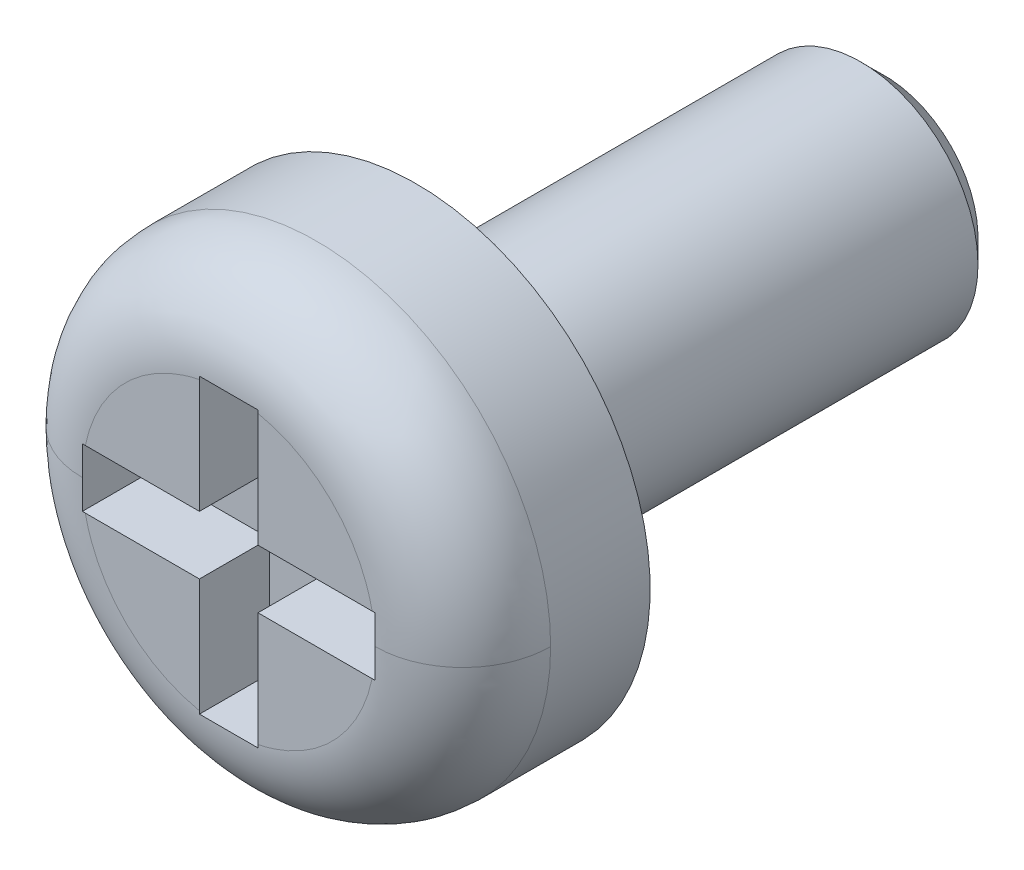
ISO-10303-21;
HEADER;
FILE_DESCRIPTION(('STEP AP214'),'2;1');
FILE_NAME('part.step','',(''),(''),'','','');
FILE_SCHEMA(('AUTOMOTIVE_DESIGN { 1 0 10303 214 1 1 1 1 }'));
ENDSEC;
DATA;
#1=APPLICATION_CONTEXT('core data for automotive mechanical design processes');
#2=APPLICATION_PROTOCOL_DEFINITION('international standard','automotive_design',2000,#1);
#3=PRODUCT_CONTEXT('',#1,'mechanical');
#4=PRODUCT('Part','Part','',(#3));
#5=PRODUCT_RELATED_PRODUCT_CATEGORY('part','',(#4));
#6=PRODUCT_DEFINITION_FORMATION('','',#4);
#7=PRODUCT_DEFINITION_CONTEXT('part definition',#1,'design');
#8=PRODUCT_DEFINITION('design','',#6,#7);
#9=PRODUCT_DEFINITION_SHAPE('','',#8);
#10=(LENGTH_UNIT() NAMED_UNIT(*) SI_UNIT(.MILLI.,.METRE.));
#11=(NAMED_UNIT(*) PLANE_ANGLE_UNIT() SI_UNIT($,.RADIAN.));
#12=(NAMED_UNIT(*) SI_UNIT($,.STERADIAN.) SOLID_ANGLE_UNIT());
#13=UNCERTAINTY_MEASURE_WITH_UNIT(LENGTH_MEASURE(1.E-05),#10,'distance_accuracy_value','');
#14=(GEOMETRIC_REPRESENTATION_CONTEXT(3) GLOBAL_UNCERTAINTY_ASSIGNED_CONTEXT((#13)) GLOBAL_UNIT_ASSIGNED_CONTEXT((#10,
#11,#12)) REPRESENTATION_CONTEXT('',''));
#15=CARTESIAN_POINT('',(0.,0.,0.));
#16=DIRECTION('',(0.,0.,1.));
#17=DIRECTION('',(1.,0.,0.));
#18=AXIS2_PLACEMENT_3D('',#15,#16,#17);
#19=CARTESIAN_POINT('',(-0.25,1.25,1.));
#20=DIRECTION('',(0.,0.,-1.));
#21=DIRECTION('',(-1.,0.,0.));
#22=AXIS2_PLACEMENT_3D('',#19,#20,#21);
#23=PLANE('',#22);
#24=DIRECTION('',(0.,-1.,0.));
#25=VECTOR('',#24,1.);
#26=CARTESIAN_POINT('',(-1.25,0.250000000000013,1.));
#27=LINE('',#26,#25);
#28=CARTESIAN_POINT('',(-1.25,0.250000000000013,1.));
#29=VERTEX_POINT('',#28);
#30=CARTESIAN_POINT('',(-1.25,-0.249999999999987,1.));
#31=VERTEX_POINT('',#30);
#32=EDGE_CURVE('E417',#29,#31,#27,.T.);
#33=ORIENTED_EDGE('',*,*,#32,.T.);
#34=DIRECTION('',(1.,0.,0.));
#35=VECTOR('',#34,1.);
#36=CARTESIAN_POINT('',(-1.25,-0.249999999999987,1.));
#37=LINE('',#36,#35);
#38=CARTESIAN_POINT('',(-0.250000000000001,-0.249999999999998,1.));
#39=VERTEX_POINT('',#38);
#40=EDGE_CURVE('E352',#31,#39,#37,.T.);
#41=ORIENTED_EDGE('',*,*,#40,.T.);
#42=DIRECTION('',(0.,-1.,0.));
#43=VECTOR('',#42,1.);
#44=CARTESIAN_POINT('',(-0.250000000000009,-1.25,1.));
#45=LINE('',#44,#43);
#46=CARTESIAN_POINT('',(-0.250000000000009,-1.25,1.));
#47=VERTEX_POINT('',#46);
#48=EDGE_CURVE('E586',#39,#47,#45,.T.);
#49=ORIENTED_EDGE('',*,*,#48,.T.);
#50=DIRECTION('',(1.,0.,0.));
#51=VECTOR('',#50,1.);
#52=CARTESIAN_POINT('',(-0.250000000000009,-1.25,1.));
#53=LINE('',#52,#51);
#54=CARTESIAN_POINT('',(0.249999999999991,-1.25,1.));
#55=VERTEX_POINT('',#54);
#56=EDGE_CURVE('E400',#47,#55,#53,.T.);
#57=ORIENTED_EDGE('',*,*,#56,.T.);
#58=DIRECTION('',(0.,1.,0.));
#59=VECTOR('',#58,1.);
#60=CARTESIAN_POINT('',(0.249999999999991,-1.25,1.));
#61=LINE('',#60,#59);
#62=CARTESIAN_POINT('',(0.249999999999999,-0.25,1.));
#63=VERTEX_POINT('',#62);
#64=EDGE_CURVE('E394',#55,#63,#61,.T.);
#65=ORIENTED_EDGE('',*,*,#64,.T.);
#66=DIRECTION('',(1.,0.,0.));
#67=VECTOR('',#66,1.);
#68=CARTESIAN_POINT('',(1.25,-0.250000000000005,1.));
#69=LINE('',#68,#67);
#70=CARTESIAN_POINT('',(1.25,-0.250000000000005,1.));
#71=VERTEX_POINT('',#70);
#72=EDGE_CURVE('E409',#63,#71,#69,.T.);
#73=ORIENTED_EDGE('',*,*,#72,.T.);
#74=DIRECTION('',(0.,1.,0.));
#75=VECTOR('',#74,1.);
#76=CARTESIAN_POINT('',(1.25,-0.250000000000005,1.));
#77=LINE('',#76,#75);
#78=CARTESIAN_POINT('',(1.25,0.249999999999995,1.));
#79=VERTEX_POINT('',#78);
#80=EDGE_CURVE('E415',#71,#79,#77,.T.);
#81=ORIENTED_EDGE('',*,*,#80,.T.);
#82=DIRECTION('',(-1.,0.,0.));
#83=VECTOR('',#82,1.);
#84=CARTESIAN_POINT('',(1.25,0.249999999999995,1.));
#85=LINE('',#84,#83);
#86=CARTESIAN_POINT('',(0.25,0.25,1.));
#87=VERTEX_POINT('',#86);
#88=EDGE_CURVE('E420',#79,#87,#85,.T.);
#89=ORIENTED_EDGE('',*,*,#88,.T.);
#90=DIRECTION('',(0.,1.,0.));
#91=VECTOR('',#90,1.);
#92=CARTESIAN_POINT('',(0.25,1.25,1.));
#93=LINE('',#92,#91);
#94=CARTESIAN_POINT('',(0.25,1.25,1.));
#95=VERTEX_POINT('',#94);
#96=EDGE_CURVE('E435',#87,#95,#93,.T.);
#97=ORIENTED_EDGE('',*,*,#96,.T.);
#98=DIRECTION('',(1.,0.,0.));
#99=VECTOR('',#98,1.);
#100=CARTESIAN_POINT('',(0.25,1.25,1.));
#101=LINE('',#100,#99);
#102=CARTESIAN_POINT('',(-0.25,1.25,1.));
#103=VERTEX_POINT('',#102);
#104=EDGE_CURVE('E441',#95,#103,#101,.F.);
#105=ORIENTED_EDGE('',*,*,#104,.T.);
#106=DIRECTION('',(0.,-1.,0.));
#107=VECTOR('',#106,1.);
#108=CARTESIAN_POINT('',(-0.25,1.25,1.));
#109=LINE('',#108,#107);
#110=CARTESIAN_POINT('',(-0.25,0.25,1.));
#111=VERTEX_POINT('',#110);
#112=EDGE_CURVE('E446',#103,#111,#109,.T.);
#113=ORIENTED_EDGE('',*,*,#112,.T.);
#114=DIRECTION('',(-1.,0.,0.));
#115=VECTOR('',#114,1.);
#116=CARTESIAN_POINT('',(-1.25,0.250000000000013,1.));
#117=LINE('',#116,#115);
#118=EDGE_CURVE('E426',#111,#29,#117,.T.);
#119=ORIENTED_EDGE('',*,*,#118,.T.);
#120=EDGE_LOOP('',(#33,#41,#49,#57,#65,#73,#81,#89,#97,#105,#113,#119));
#121=FACE_BOUND('',#120,.T.);
#122=ADVANCED_FACE('F17',(#121),#23,.F.);
#123=CARTESIAN_POINT('',(-1.25,0.250000000000013,1.));
#124=DIRECTION('',(0.,1.,0.));
#125=DIRECTION('',(-1.,0.,0.));
#126=AXIS2_PLACEMENT_3D('',#123,#124,#125);
#127=PLANE('',#126);
#128=ORIENTED_EDGE('',*,*,#118,.F.);
#129=DIRECTION('',(0.,0.,1.));
#130=VECTOR('',#129,1.);
#131=CARTESIAN_POINT('',(-0.25,0.25,1.));
#132=LINE('',#131,#130);
#133=CARTESIAN_POINT('',(-0.25,0.250000000000004,1.6));
#134=VERTEX_POINT('',#133);
#135=EDGE_CURVE('E448',#111,#134,#132,.T.);
#136=ORIENTED_EDGE('',*,*,#135,.T.);
#137=DIRECTION('',(1.,0.,0.));
#138=VECTOR('',#137,1.);
#139=CARTESIAN_POINT('',(0.,0.250000000000013,1.6));
#140=LINE('',#139,#138);
#141=CARTESIAN_POINT('',(-1.22474487139158,0.250000000000013,1.6));
#142=VERTEX_POINT('',#141);
#143=EDGE_CURVE('E428',#142,#134,#140,.T.);
#144=ORIENTED_EDGE('',*,*,#143,.F.);
#145=CARTESIAN_POINT('',(-1.25,0.250000000000013,1.59959135266857));
#146=CARTESIAN_POINT('',(-1.24579191431409,0.250000000000013,1.59972759178636));
#147=CARTESIAN_POINT('',(-1.24158327742043,0.250000000000013,1.59982976528954));
#148=CARTESIAN_POINT('',(-1.23316490121763,0.250000000000013,1.59996598106669));
#149=CARTESIAN_POINT('',(-1.22895516190848,0.250000000000013,1.60000002334065));
#150=CARTESIAN_POINT('',(-1.22474487139158,0.250000000000013,1.6));
#151=B_SPLINE_CURVE_WITH_KNOTS('',3,(#145,#146,#147,#148,#149,#150),.UNSPECIFIED.,.F.,.F.,(4,2,
4),(0.,0.0126296308475995,0.0252592616951993),.UNSPECIFIED.);
#152=CARTESIAN_POINT('',(-1.25,0.250000000000013,1.59959135266857));
#153=VERTEX_POINT('',#152);
#154=EDGE_CURVE('E154',#153,#142,#151,.T.);
#155=ORIENTED_EDGE('',*,*,#154,.F.);
#156=DIRECTION('',(0.,0.,1.));
#157=VECTOR('',#156,1.);
#158=CARTESIAN_POINT('',(-1.25,0.250000000000013,1.));
#159=LINE('',#158,#157);
#160=EDGE_CURVE('E151',#153,#29,#159,.F.);
#161=ORIENTED_EDGE('',*,*,#160,.T.);
#162=EDGE_LOOP('',(#128,#136,#144,#155,#161));
#163=FACE_BOUND('',#162,.T.);
#164=ADVANCED_FACE('F485',(#163),#127,.F.);
#165=CARTESIAN_POINT('',(0.,0.,1.6));
#166=DIRECTION('',(0.,0.,1.));
#167=DIRECTION('',(1.,0.,0.));
#168=AXIS2_PLACEMENT_3D('',#165,#166,#167);
#169=PLANE('',#168);
#170=ORIENTED_EDGE('',*,*,#143,.T.);
#171=DIRECTION('',(0.,-1.,0.));
#172=VECTOR('',#171,1.);
#173=CARTESIAN_POINT('',(-0.25,1.25,1.6));
#174=LINE('',#173,#172);
#175=CARTESIAN_POINT('',(-0.249999999999999,1.22474487139159,1.6));
#176=VERTEX_POINT('',#175);
#177=EDGE_CURVE('E443',#134,#176,#174,.F.);
#178=ORIENTED_EDGE('',*,*,#177,.T.);
#179=CARTESIAN_POINT('',(-1.25,0.,1.6));
#180=CARTESIAN_POINT('',(-1.25,2.49999999999999,1.6));
#181=CARTESIAN_POINT('',(1.25,2.49999999999999,1.6));
#182=CARTESIAN_POINT('',(1.25,0.,1.6));
#183=(BOUNDED_CURVE() B_SPLINE_CURVE(3,(#179,#180,#181,#182),.UNSPECIFIED.,.F.,
.F.) B_SPLINE_CURVE_WITH_KNOTS((4,4),(0.,1.),
.UNSPECIFIED.) CURVE() GEOMETRIC_REPRESENTATION_ITEM() RATIONAL_B_SPLINE_CURVE((1.,
0.333333333333333,0.333333333333333,1.)) REPRESENTATION_ITEM(''));
#184=EDGE_CURVE('E469',#142,#176,#183,.T.);
#185=ORIENTED_EDGE('',*,*,#184,.F.);
#186=EDGE_LOOP('',(#170,#178,#185));
#187=FACE_BOUND('',#186,.T.);
#188=ADVANCED_FACE('F475',(#187),#169,.T.);
#189=CARTESIAN_POINT('',(-0.25,1.25,1.));
#190=DIRECTION('',(-1.,0.,0.));
#191=DIRECTION('',(0.,-1.,0.));
#192=AXIS2_PLACEMENT_3D('',#189,#190,#191);
#193=PLANE('',#192);
#194=ORIENTED_EDGE('',*,*,#135,.F.);
#195=ORIENTED_EDGE('',*,*,#112,.F.);
#196=DIRECTION('',(0.,0.,1.));
#197=VECTOR('',#196,1.);
#198=CARTESIAN_POINT('',(-0.25,1.25,1.));
#199=LINE('',#198,#197);
#200=CARTESIAN_POINT('',(-0.250000000000034,1.25,1.59959135266857));
#201=VERTEX_POINT('',#200);
#202=EDGE_CURVE('E438',#103,#201,#199,.T.);
#203=ORIENTED_EDGE('',*,*,#202,.T.);
#204=CARTESIAN_POINT('',(-0.249999999999998,1.22474487139159,1.6));
#205=CARTESIAN_POINT('',(-0.249999999999999,1.22895516190857,1.60000002334065));
#206=CARTESIAN_POINT('',(-0.25,1.2331649012178,1.59996598106669));
#207=CARTESIAN_POINT('',(-0.25,1.24158327742077,1.59982976528954));
#208=CARTESIAN_POINT('',(-0.25,1.24579191431452,1.59972759178635));
#209=CARTESIAN_POINT('',(-0.25,1.25000000000051,1.59959135266855));
#210=B_SPLINE_CURVE_WITH_KNOTS('',3,(#204,#205,#206,#207,#208,#209),.UNSPECIFIED.,.F.,.F.,(4,2,
4),(0.,0.0126296308478546,0.0252592616957089),.UNSPECIFIED.);
#211=EDGE_CURVE('E501',#176,#201,#210,.T.);
#212=ORIENTED_EDGE('',*,*,#211,.F.);
#213=ORIENTED_EDGE('',*,*,#177,.F.);
#214=EDGE_LOOP('',(#194,#195,#203,#212,#213));
#215=FACE_BOUND('',#214,.T.);
#216=ADVANCED_FACE('F484',(#215),#193,.F.);
#217=CARTESIAN_POINT('',(0.25,1.25,1.));
#218=DIRECTION('',(0.,1.,0.));
#219=DIRECTION('',(0.,0.,1.));
#220=AXIS2_PLACEMENT_3D('',#217,#218,#219);
#221=PLANE('',#220);
#222=ORIENTED_EDGE('',*,*,#104,.F.);
#223=DIRECTION('',(0.,0.,1.));
#224=VECTOR('',#223,1.);
#225=CARTESIAN_POINT('',(0.25,1.25,1.));
#226=LINE('',#225,#224);
#227=CARTESIAN_POINT('',(0.25,1.25000000000026,1.59959135266856));
#228=VERTEX_POINT('',#227);
#229=EDGE_CURVE('E437',#95,#228,#226,.T.);
#230=ORIENTED_EDGE('',*,*,#229,.T.);
#231=CARTESIAN_POINT('',(-0.250000000000068,1.25,1.59959135266857));
#232=CARTESIAN_POINT('',(-0.208333536894507,1.25,1.5998292338899));
#233=CARTESIAN_POINT('',(-0.166666879369885,1.25,1.59993139567793));
#234=CARTESIAN_POINT('',(-0.0833334812298284,1.25,1.60001677857408));
#235=CARTESIAN_POINT('',(-0.0416667406149141,1.25,1.6));
#236=CARTESIAN_POINT('',(0.0416667406149145,1.25,1.6));
#237=CARTESIAN_POINT('',(0.0833334812298288,1.25,1.60001677857408));
#238=CARTESIAN_POINT('',(0.166666879369885,1.25,1.59993139567793));
#239=CARTESIAN_POINT('',(0.208333536894507,1.25,1.5998292338899));
#240=CARTESIAN_POINT('',(0.250000000000069,1.25,1.59959135266857));
#241=B_SPLINE_CURVE_WITH_KNOTS('',3,(#231,#232,#233,#234,#235,#236,#237,#238,#239,#240),
.UNSPECIFIED.,.F.,.F.,(4,2,2,2,4),(0.,0.125000461306252,0.250000588628007,0.375000715949762,
0.500001177256014),.UNSPECIFIED.);
#242=EDGE_CURVE('E504',#201,#228,#241,.T.);
#243=ORIENTED_EDGE('',*,*,#242,.F.);
#244=ORIENTED_EDGE('',*,*,#202,.F.);
#245=EDGE_LOOP('',(#222,#230,#243,#244));
#246=FACE_BOUND('',#245,.T.);
#247=ADVANCED_FACE('F517',(#246),#221,.F.);
#248=CARTESIAN_POINT('',(0.25,1.25,1.));
#249=DIRECTION('',(1.,0.,0.));
#250=DIRECTION('',(0.,1.,0.));
#251=AXIS2_PLACEMENT_3D('',#248,#249,#250);
#252=PLANE('',#251);
#253=ORIENTED_EDGE('',*,*,#96,.F.);
#254=DIRECTION('',(0.,0.,1.));
#255=VECTOR('',#254,1.);
#256=CARTESIAN_POINT('',(0.25,0.25,1.));
#257=LINE('',#256,#255);
#258=CARTESIAN_POINT('',(0.25,0.25,1.6));
#259=VERTEX_POINT('',#258);
#260=EDGE_CURVE('E422',#87,#259,#257,.T.);
#261=ORIENTED_EDGE('',*,*,#260,.T.);
#262=DIRECTION('',(0.,1.,0.));
#263=VECTOR('',#262,1.);
#264=CARTESIAN_POINT('',(0.25,0.,1.6));
#265=LINE('',#264,#263);
#266=CARTESIAN_POINT('',(0.25,1.22474487139159,1.6));
#267=VERTEX_POINT('',#266);
#268=EDGE_CURVE('E423',#267,#259,#265,.F.);
#269=ORIENTED_EDGE('',*,*,#268,.F.);
#270=CARTESIAN_POINT('',(0.25,1.25000000000051,1.59959135266855));
#271=CARTESIAN_POINT('',(0.25,1.24579191431452,1.59972759178635));
#272=CARTESIAN_POINT('',(0.25,1.24158327742077,1.59982976528954));
#273=CARTESIAN_POINT('',(0.25,1.2331649012178,1.59996598106669));
#274=CARTESIAN_POINT('',(0.25,1.22895516190857,1.60000002334065));
#275=CARTESIAN_POINT('',(0.25,1.22474487139159,1.6));
#276=B_SPLINE_CURVE_WITH_KNOTS('',3,(#270,#271,#272,#273,#274,#275),.UNSPECIFIED.,.F.,.F.,(4,2,
4),(0.,0.0126296308478545,0.0252592616957091),.UNSPECIFIED.);
#277=EDGE_CURVE('E510',#228,#267,#276,.T.);
#278=ORIENTED_EDGE('',*,*,#277,.F.);
#279=ORIENTED_EDGE('',*,*,#229,.F.);
#280=EDGE_LOOP('',(#253,#261,#269,#278,#279));
#281=FACE_BOUND('',#280,.T.);
#282=ADVANCED_FACE('F520',(#281),#252,.F.);
#283=CARTESIAN_POINT('',(0.,0.,1.6));
#284=DIRECTION('',(0.,0.,1.));
#285=DIRECTION('',(1.,0.,0.));
#286=AXIS2_PLACEMENT_3D('',#283,#284,#285);
#287=PLANE('',#286);
#288=CARTESIAN_POINT('',(-1.25,0.,1.6));
#289=CARTESIAN_POINT('',(-1.25,2.49999999999999,1.6));
#290=CARTESIAN_POINT('',(1.25,2.49999999999999,1.6));
#291=CARTESIAN_POINT('',(1.25,0.,1.6));
#292=(BOUNDED_CURVE() B_SPLINE_CURVE(3,(#288,#289,#290,#291),.UNSPECIFIED.,.F.,
.F.) B_SPLINE_CURVE_WITH_KNOTS((4,4),(0.,1.),
.UNSPECIFIED.) CURVE() GEOMETRIC_REPRESENTATION_ITEM() RATIONAL_B_SPLINE_CURVE((1.,
0.333333333333333,0.333333333333333,1.)) REPRESENTATION_ITEM(''));
#293=CARTESIAN_POINT('',(1.22474487139159,0.249999999999995,1.6));
#294=VERTEX_POINT('',#293);
#295=EDGE_CURVE('E551',#267,#294,#292,.T.);
#296=ORIENTED_EDGE('',*,*,#295,.F.);
#297=ORIENTED_EDGE('',*,*,#268,.T.);
#298=DIRECTION('',(-1.,0.,0.));
#299=VECTOR('',#298,1.);
#300=CARTESIAN_POINT('',(1.25,0.249999999999995,1.6));
#301=LINE('',#300,#299);
#302=EDGE_CURVE('E432',#259,#294,#301,.F.);
#303=ORIENTED_EDGE('',*,*,#302,.T.);
#304=EDGE_LOOP('',(#296,#297,#303));
#305=FACE_BOUND('',#304,.T.);
#306=ADVANCED_FACE('F525',(#305),#287,.T.);
#307=CARTESIAN_POINT('',(1.25,0.249999999999995,1.));
#308=DIRECTION('',(0.,1.,0.));
#309=DIRECTION('',(-1.,0.,0.));
#310=AXIS2_PLACEMENT_3D('',#307,#308,#309);
#311=PLANE('',#310);
#312=ORIENTED_EDGE('',*,*,#260,.F.);
#313=ORIENTED_EDGE('',*,*,#88,.F.);
#314=DIRECTION('',(0.,0.,1.));
#315=VECTOR('',#314,1.);
#316=CARTESIAN_POINT('',(1.25,0.249999999999995,1.));
#317=LINE('',#316,#315);
#318=CARTESIAN_POINT('',(1.25,0.249999999999996,1.59959135266857));
#319=VERTEX_POINT('',#318);
#320=EDGE_CURVE('E412',#79,#319,#317,.T.);
#321=ORIENTED_EDGE('',*,*,#320,.T.);
#322=CARTESIAN_POINT('',(1.22474487139159,0.249999999999995,1.6));
#323=CARTESIAN_POINT('',(1.22895516190848,0.249999999999995,1.60000002334065));
#324=CARTESIAN_POINT('',(1.23316490121763,0.249999999999995,1.59996598106669));
#325=CARTESIAN_POINT('',(1.24158327742043,0.249999999999996,1.59982976528954));
#326=CARTESIAN_POINT('',(1.24579191431409,0.249999999999996,1.59972759178636));
#327=CARTESIAN_POINT('',(1.25,0.249999999999995,1.59959135266857));
#328=B_SPLINE_CURVE_WITH_KNOTS('',3,(#322,#323,#324,#325,#326,#327),.UNSPECIFIED.,.F.,.F.,(4,2,
4),(0.,0.0126296308476,0.0252592616951993),.UNSPECIFIED.);
#329=EDGE_CURVE('E170',#294,#319,#328,.T.);
#330=ORIENTED_EDGE('',*,*,#329,.F.);
#331=ORIENTED_EDGE('',*,*,#302,.F.);
#332=EDGE_LOOP('',(#312,#313,#321,#330,#331));
#333=FACE_BOUND('',#332,.T.);
#334=ADVANCED_FACE('F272',(#333),#311,.F.);
#335=CARTESIAN_POINT('',(-1.25,0.250000000000013,1.));
#336=DIRECTION('',(-1.,0.,0.));
#337=DIRECTION('',(0.,-1.,0.));
#338=AXIS2_PLACEMENT_3D('',#335,#336,#337);
#339=PLANE('',#338);
#340=DIRECTION('',(0.,0.,1.));
#341=VECTOR('',#340,1.);
#342=CARTESIAN_POINT('',(-1.25,-0.249999999999987,1.));
#343=LINE('',#342,#341);
#344=CARTESIAN_POINT('',(-1.25,-0.249999999999987,1.59959135266857));
#345=VERTEX_POINT('',#344);
#346=EDGE_CURVE('E350',#345,#31,#343,.F.);
#347=ORIENTED_EDGE('',*,*,#346,.T.);
#348=ORIENTED_EDGE('',*,*,#32,.F.);
#349=ORIENTED_EDGE('',*,*,#160,.F.);
#350=CARTESIAN_POINT('',(-1.25,0.,1.6));
#351=CARTESIAN_POINT('',(-1.25,0.0208334063916283,1.59999784579777));
#352=CARTESIAN_POINT('',(-1.25,0.0416668094992223,1.59999999858943));
#353=CARTESIAN_POINT('',(-1.25,0.0833335717079367,1.59999675022065));
#354=CARTESIAN_POINT('',(-1.25,0.10416693080906,1.5999913490756));
#355=CARTESIAN_POINT('',(-1.25,0.145833672240225,1.59995682500012));
#356=CARTESIAN_POINT('',(-1.25,0.16666705457027,1.59992770204714));
#357=CARTESIAN_POINT('',(-1.25,0.208333684297753,1.59981152660782));
#358=CARTESIAN_POINT('',(-1.25,0.22916693169483,1.59972447400346));
#359=CARTESIAN_POINT('',(-1.24999999999999,0.250000000000014,1.59959135266857));
#360=B_SPLINE_CURVE_WITH_KNOTS('',3,(#350,#351,#352,#353,#354,#355,#356,#357,#358,#359),
.UNSPECIFIED.,.F.,.F.,(4,2,2,2,4),(0.,0.0625002118449792,0.125000296368392,0.187500440270152,
0.250000711493357),.UNSPECIFIED.);
#361=CARTESIAN_POINT('',(-1.25,0.,1.6));
#362=VERTEX_POINT('',#361);
#363=EDGE_CURVE('E20',#362,#153,#360,.T.);
#364=ORIENTED_EDGE('',*,*,#363,.F.);
#365=CARTESIAN_POINT('',(-1.25,-0.249999999999987,1.59959135266857));
#366=CARTESIAN_POINT('',(-1.25,-0.229166931694806,1.59972447400346));
#367=CARTESIAN_POINT('',(-1.25,-0.208333684297731,1.59981152660782));
#368=CARTESIAN_POINT('',(-1.25,-0.166667054570252,1.59992770204714));
#369=CARTESIAN_POINT('',(-1.25,-0.14583367224021,1.59995682500012));
#370=CARTESIAN_POINT('',(-1.25,-0.104166930809049,1.5999913490756));
#371=CARTESIAN_POINT('',(-1.25,-0.0833335717079277,1.59999675022065));
#372=CARTESIAN_POINT('',(-1.25,-0.0416668094992176,1.59999999858943));
#373=CARTESIAN_POINT('',(-1.25,-0.0208334063916259,1.59999784579777));
#374=CARTESIAN_POINT('',(-1.24999999999999,0.,1.6));
#375=B_SPLINE_CURVE_WITH_KNOTS('',3,(#365,#366,#367,#368,#369,#370,#371,#372,#373,#374),
.UNSPECIFIED.,.F.,.F.,(4,2,2,2,4),(0.,0.0625002712231991,0.125000415124953,0.187500499648359,
0.250000711493331),.UNSPECIFIED.);
#376=EDGE_CURVE('E147',#345,#362,#375,.T.);
#377=ORIENTED_EDGE('',*,*,#376,.F.);
#378=EDGE_LOOP('',(#347,#348,#349,#364,#377));
#379=FACE_BOUND('',#378,.T.);
#380=ADVANCED_FACE('F145',(#379),#339,.F.);
#381=CARTESIAN_POINT('',(1.25,-0.250000000000005,1.));
#382=DIRECTION('',(1.,0.,0.));
#383=DIRECTION('',(0.,1.,0.));
#384=AXIS2_PLACEMENT_3D('',#381,#382,#383);
#385=PLANE('',#384);
#386=ORIENTED_EDGE('',*,*,#320,.F.);
#387=ORIENTED_EDGE('',*,*,#80,.F.);
#388=DIRECTION('',(0.,0.,1.));
#389=VECTOR('',#388,1.);
#390=CARTESIAN_POINT('',(1.25,-0.250000000000005,1.));
#391=LINE('',#390,#389);
#392=CARTESIAN_POINT('',(1.25,-0.250000000000005,1.59959135266857));
#393=VERTEX_POINT('',#392);
#394=EDGE_CURVE('E411',#71,#393,#391,.T.);
#395=ORIENTED_EDGE('',*,*,#394,.T.);
#396=CARTESIAN_POINT('',(1.25,0.,1.6));
#397=CARTESIAN_POINT('',(1.25,-0.0208334063916278,1.59999784579777));
#398=CARTESIAN_POINT('',(1.25,-0.041666809499221,1.59999999858943));
#399=CARTESIAN_POINT('',(1.25,-0.083333571707934,1.59999675022065));
#400=CARTESIAN_POINT('',(1.25,-0.104166930809057,1.5999913490756));
#401=CARTESIAN_POINT('',(1.25,-0.14583367224022,1.59995682500012));
#402=CARTESIAN_POINT('',(1.25,-0.166667054570264,1.59992770204714));
#403=CARTESIAN_POINT('',(1.25,-0.208333684297746,1.59981152660782));
#404=CARTESIAN_POINT('',(1.25,-0.229166931694822,1.59972447400346));
#405=CARTESIAN_POINT('',(1.24999999999999,-0.250000000000005,1.59959135266857));
#406=B_SPLINE_CURVE_WITH_KNOTS('',3,(#396,#397,#398,#399,#400,#401,#402,#403,#404,#405),
.UNSPECIFIED.,.F.,.F.,(4,2,2,2,4),(0.,0.0625002118449771,0.125000296368388,0.187500440270145,
0.250000711493349),.UNSPECIFIED.);
#407=CARTESIAN_POINT('',(1.25,0.,1.6));
#408=VERTEX_POINT('',#407);
#409=EDGE_CURVE('E177',#408,#393,#406,.T.);
#410=ORIENTED_EDGE('',*,*,#409,.F.);
#411=CARTESIAN_POINT('',(1.25,0.249999999999996,1.59959135266857));
#412=CARTESIAN_POINT('',(1.25,0.229166931694814,1.59972447400346));
#413=CARTESIAN_POINT('',(1.25,0.208333684297738,1.59981152660782));
#414=CARTESIAN_POINT('',(1.25,0.166667054570258,1.59992770204714));
#415=CARTESIAN_POINT('',(1.25,0.145833672240215,1.59995682500012));
#416=CARTESIAN_POINT('',(1.25,0.104166930809053,1.5999913490756));
#417=CARTESIAN_POINT('',(1.25,0.0833335717079307,1.59999675022065));
#418=CARTESIAN_POINT('',(1.25,0.0416668094992192,1.59999999858943));
#419=CARTESIAN_POINT('',(1.25,0.0208334063916268,1.59999784579777));
#420=CARTESIAN_POINT('',(1.24999999999999,0.,1.6));
#421=B_SPLINE_CURVE_WITH_KNOTS('',3,(#411,#412,#413,#414,#415,#416,#417,#418,#419,#420),
.UNSPECIFIED.,.F.,.F.,(4,2,2,2,4),(0.,0.0625002712232013,0.125000415124957,0.187500499648365,
0.25000071149334),.UNSPECIFIED.);
#422=EDGE_CURVE('E168',#319,#408,#421,.T.);
#423=ORIENTED_EDGE('',*,*,#422,.F.);
#424=EDGE_LOOP('',(#386,#387,#395,#410,#423));
#425=FACE_BOUND('',#424,.T.);
#426=ADVANCED_FACE('F261',(#425),#385,.F.);
#427=CARTESIAN_POINT('',(1.25,-0.250000000000005,1.));
#428=DIRECTION('',(0.,-1.,0.));
#429=DIRECTION('',(1.,0.,0.));
#430=AXIS2_PLACEMENT_3D('',#427,#428,#429);
#431=PLANE('',#430);
#432=ORIENTED_EDGE('',*,*,#72,.F.);
#433=DIRECTION('',(0.,0.,1.));
#434=VECTOR('',#433,1.);
#435=CARTESIAN_POINT('',(0.249999999999999,-0.25,1.));
#436=LINE('',#435,#434);
#437=CARTESIAN_POINT('',(0.249999999999999,-0.250000000000002,1.6));
#438=VERTEX_POINT('',#437);
#439=EDGE_CURVE('E393',#63,#438,#436,.T.);
#440=ORIENTED_EDGE('',*,*,#439,.T.);
#441=DIRECTION('',(1.,0.,0.));
#442=VECTOR('',#441,1.);
#443=CARTESIAN_POINT('',(0.,-0.250000000000005,1.6));
#444=LINE('',#443,#442);
#445=CARTESIAN_POINT('',(1.22474487139159,-0.250000000000004,1.6));
#446=VERTEX_POINT('',#445);
#447=EDGE_CURVE('E402',#446,#438,#444,.F.);
#448=ORIENTED_EDGE('',*,*,#447,.F.);
#449=CARTESIAN_POINT('',(1.25,-0.250000000000004,1.59959135266857));
#450=CARTESIAN_POINT('',(1.24579191431409,-0.250000000000004,1.59972759178636));
#451=CARTESIAN_POINT('',(1.24158327742043,-0.250000000000005,1.59982976528954));
#452=CARTESIAN_POINT('',(1.23316490121763,-0.250000000000004,1.59996598106669));
#453=CARTESIAN_POINT('',(1.22895516190848,-0.250000000000004,1.60000002334065));
#454=CARTESIAN_POINT('',(1.22474487139159,-0.250000000000004,1.6));
#455=B_SPLINE_CURVE_WITH_KNOTS('',3,(#449,#450,#451,#452,#453,#454),.UNSPECIFIED.,.F.,.F.,(4,2,
4),(0.,0.0126296308475993,0.0252592616951984),.UNSPECIFIED.);
#456=EDGE_CURVE('E255',#393,#446,#455,.T.);
#457=ORIENTED_EDGE('',*,*,#456,.F.);
#458=ORIENTED_EDGE('',*,*,#394,.F.);
#459=EDGE_LOOP('',(#432,#440,#448,#457,#458));
#460=FACE_BOUND('',#459,.T.);
#461=ADVANCED_FACE('F256',(#460),#431,.F.);
#462=CARTESIAN_POINT('',(0.,0.,1.6));
#463=DIRECTION('',(0.,0.,1.));
#464=DIRECTION('',(1.,0.,0.));
#465=AXIS2_PLACEMENT_3D('',#462,#463,#464);
#466=PLANE('',#465);
#467=CARTESIAN_POINT('',(1.25,0.,1.6));
#468=CARTESIAN_POINT('',(1.25,-2.49999999999999,1.6));
#469=CARTESIAN_POINT('',(-1.25,-2.49999999999999,1.6));
#470=CARTESIAN_POINT('',(-1.25,0.,1.6));
#471=(BOUNDED_CURVE() B_SPLINE_CURVE(3,(#467,#468,#469,#470),.UNSPECIFIED.,.F.,
.F.) B_SPLINE_CURVE_WITH_KNOTS((4,4),(0.,1.),
.UNSPECIFIED.) CURVE() GEOMETRIC_REPRESENTATION_ITEM() RATIONAL_B_SPLINE_CURVE((1.,
0.333333333333333,0.333333333333333,1.)) REPRESENTATION_ITEM(''));
#472=CARTESIAN_POINT('',(0.249999999999991,-1.22474487139159,1.6));
#473=VERTEX_POINT('',#472);
#474=EDGE_CURVE('E318',#446,#473,#471,.T.);
#475=ORIENTED_EDGE('',*,*,#474,.F.);
#476=ORIENTED_EDGE('',*,*,#447,.T.);
#477=DIRECTION('',(0.,1.,0.));
#478=VECTOR('',#477,1.);
#479=CARTESIAN_POINT('',(0.249999999999991,-1.25,1.6));
#480=LINE('',#479,#478);
#481=EDGE_CURVE('E396',#438,#473,#480,.F.);
#482=ORIENTED_EDGE('',*,*,#481,.T.);
#483=EDGE_LOOP('',(#475,#476,#482));
#484=FACE_BOUND('',#483,.T.);
#485=ADVANCED_FACE('F260',(#484),#466,.T.);
#486=CARTESIAN_POINT('',(0.249999999999991,-1.25,1.));
#487=DIRECTION('',(1.,0.,0.));
#488=DIRECTION('',(0.,1.,0.));
#489=AXIS2_PLACEMENT_3D('',#486,#487,#488);
#490=PLANE('',#489);
#491=ORIENTED_EDGE('',*,*,#439,.F.);
#492=ORIENTED_EDGE('',*,*,#64,.F.);
#493=DIRECTION('',(0.,0.,1.));
#494=VECTOR('',#493,1.);
#495=CARTESIAN_POINT('',(0.249999999999991,-1.25,1.));
#496=LINE('',#495,#494);
#497=CARTESIAN_POINT('',(0.250000000000025,-1.25,1.59959135266857));
#498=VERTEX_POINT('',#497);
#499=EDGE_CURVE('E589',#55,#498,#496,.T.);
#500=ORIENTED_EDGE('',*,*,#499,.T.);
#501=CARTESIAN_POINT('',(0.249999999999991,-1.22474487139159,1.6));
#502=CARTESIAN_POINT('',(0.249999999999991,-1.22895516190857,1.60000002334065));
#503=CARTESIAN_POINT('',(0.249999999999991,-1.2331649012178,1.59996598106669));
#504=CARTESIAN_POINT('',(0.249999999999991,-1.24158327742078,1.59982976528954));
#505=CARTESIAN_POINT('',(0.249999999999992,-1.24579191431452,1.59972759178635));
#506=CARTESIAN_POINT('',(0.249999999999992,-1.25000000000051,1.59959135266855));
#507=B_SPLINE_CURVE_WITH_KNOTS('',3,(#501,#502,#503,#504,#505,#506),.UNSPECIFIED.,.F.,.F.,(4,2,
4),(0.,0.0126296308478546,0.0252592616957091),.UNSPECIFIED.);
#508=EDGE_CURVE('E315',#473,#498,#507,.T.);
#509=ORIENTED_EDGE('',*,*,#508,.F.);
#510=ORIENTED_EDGE('',*,*,#481,.F.);
#511=EDGE_LOOP('',(#491,#492,#500,#509,#510));
#512=FACE_BOUND('',#511,.T.);
#513=ADVANCED_FACE('F381',(#512),#490,.F.);
#514=CARTESIAN_POINT('',(-0.250000000000009,-1.25,1.));
#515=DIRECTION('',(0.,-1.,0.));
#516=DIRECTION('',(1.,0.,0.));
#517=AXIS2_PLACEMENT_3D('',#514,#515,#516);
#518=PLANE('',#517);
#519=ORIENTED_EDGE('',*,*,#56,.F.);
#520=DIRECTION('',(0.,0.,1.));
#521=VECTOR('',#520,1.);
#522=CARTESIAN_POINT('',(-0.250000000000009,-1.25,1.));
#523=LINE('',#522,#521);
#524=CARTESIAN_POINT('',(-0.250000000000009,-1.25000000000025,1.59959135266856));
#525=VERTEX_POINT('',#524);
#526=EDGE_CURVE('E588',#47,#525,#523,.T.);
#527=ORIENTED_EDGE('',*,*,#526,.T.);
#528=CARTESIAN_POINT('',(0.250000000000059,-1.25,1.59959135266857));
#529=CARTESIAN_POINT('',(0.208333536894498,-1.25,1.5998292338899));
#530=CARTESIAN_POINT('',(0.166666879369876,-1.25,1.59993139567793));
#531=CARTESIAN_POINT('',(0.0833334812298197,-1.25,1.60001677857408));
#532=CARTESIAN_POINT('',(0.0416667406149054,-1.25,1.6));
#533=CARTESIAN_POINT('',(-0.0416667406149231,-1.25,1.6));
#534=CARTESIAN_POINT('',(-0.0833334812298373,-1.25,1.60001677857408));
#535=CARTESIAN_POINT('',(-0.166666879369893,-1.25,1.59993139567793));
#536=CARTESIAN_POINT('',(-0.208333536894516,-1.25,1.5998292338899));
#537=CARTESIAN_POINT('',(-0.250000000000077,-1.25,1.59959135266857));
#538=B_SPLINE_CURVE_WITH_KNOTS('',3,(#528,#529,#530,#531,#532,#533,#534,#535,#536,#537),
.UNSPECIFIED.,.F.,.F.,(4,2,2,2,4),(0.,0.125000461306252,0.250000588628007,0.375000715949762,
0.500001177256014),.UNSPECIFIED.);
#539=EDGE_CURVE('E237',#498,#525,#538,.T.);
#540=ORIENTED_EDGE('',*,*,#539,.F.);
#541=ORIENTED_EDGE('',*,*,#499,.F.);
#542=EDGE_LOOP('',(#519,#527,#540,#541));
#543=FACE_BOUND('',#542,.T.);
#544=ADVANCED_FACE('F377',(#543),#518,.F.);
#545=CARTESIAN_POINT('',(-0.250000000000009,-1.25,1.));
#546=DIRECTION('',(-1.,0.,0.));
#547=DIRECTION('',(0.,-1.,0.));
#548=AXIS2_PLACEMENT_3D('',#545,#546,#547);
#549=PLANE('',#548);
#550=ORIENTED_EDGE('',*,*,#48,.F.);
#551=DIRECTION('',(0.,0.,1.));
#552=VECTOR('',#551,1.);
#553=CARTESIAN_POINT('',(-0.250000000000001,-0.249999999999998,1.));
#554=LINE('',#553,#552);
#555=CARTESIAN_POINT('',(-0.250000000000004,-0.249999999999998,1.6));
#556=VERTEX_POINT('',#555);
#557=EDGE_CURVE('E347',#39,#556,#554,.T.);
#558=ORIENTED_EDGE('',*,*,#557,.T.);
#559=DIRECTION('',(0.,1.,0.));
#560=VECTOR('',#559,1.);
#561=CARTESIAN_POINT('',(-0.250000000000009,0.,1.6));
#562=LINE('',#561,#560);
#563=CARTESIAN_POINT('',(-0.250000000000009,-1.22474487139159,1.6));
#564=VERTEX_POINT('',#563);
#565=EDGE_CURVE('E353',#564,#556,#562,.T.);
#566=ORIENTED_EDGE('',*,*,#565,.F.);
#567=CARTESIAN_POINT('',(-0.250000000000009,-1.25000000000051,1.59959135266855));
#568=CARTESIAN_POINT('',(-0.250000000000009,-1.24579191431451,1.59972759178635));
#569=CARTESIAN_POINT('',(-0.250000000000009,-1.24158327742077,1.59982976528954));
#570=CARTESIAN_POINT('',(-0.250000000000009,-1.2331649012178,1.59996598106669));
#571=CARTESIAN_POINT('',(-0.250000000000008,-1.22895516190856,1.60000002334065));
#572=CARTESIAN_POINT('',(-0.250000000000008,-1.22474487139158,1.6));
#573=B_SPLINE_CURVE_WITH_KNOTS('',3,(#567,#568,#569,#570,#571,#572),.UNSPECIFIED.,.F.,.F.,(4,2,
4),(0.,0.0126296308478545,0.0252592616957091),.UNSPECIFIED.);
#574=EDGE_CURVE('E310',#525,#564,#573,.T.);
#575=ORIENTED_EDGE('',*,*,#574,.F.);
#576=ORIENTED_EDGE('',*,*,#526,.F.);
#577=EDGE_LOOP('',(#550,#558,#566,#575,#576));
#578=FACE_BOUND('',#577,.T.);
#579=ADVANCED_FACE('F373',(#578),#549,.F.);
#580=CARTESIAN_POINT('',(0.,0.,1.6));
#581=DIRECTION('',(0.,0.,1.));
#582=DIRECTION('',(1.,0.,0.));
#583=AXIS2_PLACEMENT_3D('',#580,#581,#582);
#584=PLANE('',#583);
#585=CARTESIAN_POINT('',(1.25,0.,1.6));
#586=CARTESIAN_POINT('',(1.25,-2.5,1.6));
#587=CARTESIAN_POINT('',(-1.25,-2.5,1.6));
#588=CARTESIAN_POINT('',(-1.25,0.,1.6));
#589=(BOUNDED_CURVE() B_SPLINE_CURVE(3,(#585,#586,#587,#588),.UNSPECIFIED.,.F.,
.F.) B_SPLINE_CURVE_WITH_KNOTS((4,4),(0.,1.),
.UNSPECIFIED.) CURVE() GEOMETRIC_REPRESENTATION_ITEM() RATIONAL_B_SPLINE_CURVE((1.,
0.333333333333333,0.333333333333333,1.)) REPRESENTATION_ITEM(''));
#590=CARTESIAN_POINT('',(-1.22474487139159,-0.249999999999987,1.6));
#591=VERTEX_POINT('',#590);
#592=EDGE_CURVE('E308',#564,#591,#589,.T.);
#593=ORIENTED_EDGE('',*,*,#592,.F.);
#594=ORIENTED_EDGE('',*,*,#565,.T.);
#595=DIRECTION('',(1.,0.,0.));
#596=VECTOR('',#595,1.);
#597=CARTESIAN_POINT('',(-1.25,-0.249999999999987,1.6));
#598=LINE('',#597,#596);
#599=EDGE_CURVE('E155',#556,#591,#598,.F.);
#600=ORIENTED_EDGE('',*,*,#599,.T.);
#601=EDGE_LOOP('',(#593,#594,#600));
#602=FACE_BOUND('',#601,.T.);
#603=ADVANCED_FACE('F364',(#602),#584,.T.);
#604=CARTESIAN_POINT('',(-1.25,-0.249999999999987,1.));
#605=DIRECTION('',(0.,-1.,0.));
#606=DIRECTION('',(1.,0.,0.));
#607=AXIS2_PLACEMENT_3D('',#604,#605,#606);
#608=PLANE('',#607);
#609=ORIENTED_EDGE('',*,*,#557,.F.);
#610=ORIENTED_EDGE('',*,*,#40,.F.);
#611=ORIENTED_EDGE('',*,*,#346,.F.);
#612=CARTESIAN_POINT('',(-1.22474487139159,-0.249999999999986,1.6));
#613=CARTESIAN_POINT('',(-1.22895516190848,-0.249999999999987,1.60000002334065));
#614=CARTESIAN_POINT('',(-1.23316490121763,-0.249999999999987,1.59996598106669));
#615=CARTESIAN_POINT('',(-1.24158327742044,-0.249999999999987,1.59982976528954));
#616=CARTESIAN_POINT('',(-1.24579191431409,-0.249999999999987,1.59972759178636));
#617=CARTESIAN_POINT('',(-1.25,-0.249999999999987,1.59959135266857));
#618=B_SPLINE_CURVE_WITH_KNOTS('',3,(#612,#613,#614,#615,#616,#617),.UNSPECIFIED.,.F.,.F.,(4,2,
4),(0.,0.0126296308475989,0.025259261695198),.UNSPECIFIED.);
#619=EDGE_CURVE('E167',#591,#345,#618,.T.);
#620=ORIENTED_EDGE('',*,*,#619,.F.);
#621=ORIENTED_EDGE('',*,*,#599,.F.);
#622=EDGE_LOOP('',(#609,#610,#611,#620,#621));
#623=FACE_BOUND('',#622,.T.);
#624=ADVANCED_FACE('F372',(#623),#608,.F.);
#625=CARTESIAN_POINT('',(1.2393933982822,0.,1.6));
#626=CARTESIAN_POINT('',(1.2393933982822,2.4787867965644,1.6));
#627=CARTESIAN_POINT('',(-1.2393933982822,2.4787867965644,1.6));
#628=CARTESIAN_POINT('',(-1.2393933982822,0.,1.6));
#629=CARTESIAN_POINT('',(1.24292893218813,0.,1.6));
#630=CARTESIAN_POINT('',(1.24292893218813,2.48585786437626,1.6));
#631=CARTESIAN_POINT('',(-1.24292893218813,2.48585786437626,1.6));
#632=CARTESIAN_POINT('',(-1.24292893218813,0.,1.6));
#633=CARTESIAN_POINT('',(1.24646446609406,0.,1.6));
#634=CARTESIAN_POINT('',(1.24646446609406,2.49292893218813,1.6));
#635=CARTESIAN_POINT('',(-1.24646446609406,2.49292893218813,1.6));
#636=CARTESIAN_POINT('',(-1.24646446609406,0.,1.6));
#637=CARTESIAN_POINT('',(1.25,0.,1.6));
#638=CARTESIAN_POINT('',(1.25,2.49999999999999,1.6));
#639=CARTESIAN_POINT('',(-1.25,2.49999999999999,1.6));
#640=CARTESIAN_POINT('',(-1.25,0.,1.6));
#641=CARTESIAN_POINT('',(1.68933982822018,0.,1.6));
#642=CARTESIAN_POINT('',(1.68933982822018,3.37867965644035,1.6));
#643=CARTESIAN_POINT('',(-1.68933982822018,3.37867965644035,1.6));
#644=CARTESIAN_POINT('',(-1.68933982822018,0.,1.6));
#645=CARTESIAN_POINT('',(2.,0.,1.28933982822018));
#646=CARTESIAN_POINT('',(2.,4.,1.28933982822018));
#647=CARTESIAN_POINT('',(-2.,4.,1.28933982822018));
#648=CARTESIAN_POINT('',(-2.,0.,1.28933982822018));
#649=CARTESIAN_POINT('',(2.,0.,0.85));
#650=CARTESIAN_POINT('',(2.,4.,0.85));
#651=CARTESIAN_POINT('',(-2.,4.,0.85));
#652=CARTESIAN_POINT('',(-2.,0.,0.85));
#653=(BOUNDED_SURFACE() B_SPLINE_SURFACE(3,3,((#625,#626,#627,#628),(#629,#630,#631,#632),(#633,
#634,#635,#636),(#637,#638,#639,#640),(#641,#642,#643,#644),(#645,#646,#647,#648),(#649,#650,
#651,#652)),.UNSPECIFIED.,.F.,.F.,.F.) B_SPLINE_SURFACE_WITH_KNOTS((4,3,4),(4,4),(-0.01,0.,1.),
(0.,1.),.UNSPECIFIED.) GEOMETRIC_REPRESENTATION_ITEM() RATIONAL_B_SPLINE_SURFACE(((1.,
0.333333333333333,0.333333333333333,1.),(1.,0.333333333333333,0.333333333333333,1.),(1.,
0.333333333333333,0.333333333333333,1.),(1.,0.333333333333333,0.333333333333333,1.),
(0.804737854124364,0.268245951374788,0.268245951374788,0.804737854124364),(0.804737854124364,
0.268245951374788,0.268245951374788,0.804737854124364),(1.,0.333333333333333,0.333333333333333,1.))) REPRESENTATION_ITEM('') SURFACE());
#654=CARTESIAN_POINT('',(1.2393933982822,0.,1.6));
#655=CARTESIAN_POINT('',(1.24292893218813,0.,1.6));
#656=CARTESIAN_POINT('',(1.24646446609406,0.,1.6));
#657=CARTESIAN_POINT('',(1.25,0.,1.6));
#658=CARTESIAN_POINT('',(1.68933982822018,0.,1.6));
#659=CARTESIAN_POINT('',(2.,0.,1.28933982822018));
#660=CARTESIAN_POINT('',(2.,0.,0.85));
#661=(BOUNDED_CURVE() B_SPLINE_CURVE(3,(#654,#655,#656,#657,#658,#659,#660),.UNSPECIFIED.,.F.,
.F.) B_SPLINE_CURVE_WITH_KNOTS((4,3,4),(-0.01,0.,1.),
.UNSPECIFIED.) CURVE() GEOMETRIC_REPRESENTATION_ITEM() RATIONAL_B_SPLINE_CURVE((1.,1.,1.,1.,
0.804737854124364,0.804737854124364,1.)) REPRESENTATION_ITEM(''));
#662=CARTESIAN_POINT('',(2.,0.,0.85));
#663=VERTEX_POINT('',#662);
#664=EDGE_CURVE('E161',#663,#408,#661,.F.);
#665=CARTESIAN_POINT('',(0.,0.,0.85));
#666=DIRECTION('',(0.,0.,-1.));
#667=DIRECTION('',(-1.,0.,0.));
#668=AXIS2_PLACEMENT_3D('',#665,#666,#667);
#669=CIRCLE('',#668,2.);
#670=CARTESIAN_POINT('',(-2.,0.,0.85));
#671=VERTEX_POINT('',#670);
#672=EDGE_CURVE('E40',#671,#663,#669,.T.);
#673=CARTESIAN_POINT('',(-1.2393933982822,0.,1.6));
#674=CARTESIAN_POINT('',(-1.24292893218813,0.,1.6));
#675=CARTESIAN_POINT('',(-1.24646446609406,0.,1.6));
#676=CARTESIAN_POINT('',(-1.25,0.,1.6));
#677=CARTESIAN_POINT('',(-1.68933982822018,0.,1.6));
#678=CARTESIAN_POINT('',(-2.,0.,1.28933982822018));
#679=CARTESIAN_POINT('',(-2.,0.,0.85));
#680=(BOUNDED_CURVE() B_SPLINE_CURVE(3,(#673,#674,#675,#676,#677,#678,#679),.UNSPECIFIED.,.F.,
.F.) B_SPLINE_CURVE_WITH_KNOTS((4,3,4),(-0.01,0.,1.),
.UNSPECIFIED.) CURVE() GEOMETRIC_REPRESENTATION_ITEM() RATIONAL_B_SPLINE_CURVE((1.,1.,1.,1.,
0.804737854124364,0.804737854124364,1.)) REPRESENTATION_ITEM(''));
#681=EDGE_CURVE('E156',#362,#671,#680,.T.);
#682=ORIENTED_EDGE('',*,*,#664,.F.);
#683=ORIENTED_EDGE('',*,*,#672,.F.);
#684=ORIENTED_EDGE('',*,*,#681,.F.);
#685=ORIENTED_EDGE('',*,*,#363,.T.);
#686=ORIENTED_EDGE('',*,*,#154,.T.);
#687=ORIENTED_EDGE('',*,*,#184,.T.);
#688=ORIENTED_EDGE('',*,*,#211,.T.);
#689=ORIENTED_EDGE('',*,*,#242,.T.);
#690=ORIENTED_EDGE('',*,*,#277,.T.);
#691=ORIENTED_EDGE('',*,*,#295,.T.);
#692=ORIENTED_EDGE('',*,*,#329,.T.);
#693=ORIENTED_EDGE('',*,*,#422,.T.);
#694=EDGE_LOOP('',(#682,#683,#684,#685,#686,#687,#688,#689,#690,#691,#692,#693));
#695=FACE_BOUND('',#694,.T.);
#696=ADVANCED_FACE('F157',(#695),#653,.T.);
#697=CARTESIAN_POINT('',(-1.2393933982822,0.,1.6));
#698=CARTESIAN_POINT('',(-1.2393933982822,-2.4787867965644,1.6));
#699=CARTESIAN_POINT('',(1.2393933982822,-2.4787867965644,1.6));
#700=CARTESIAN_POINT('',(1.2393933982822,0.,1.6));
#701=CARTESIAN_POINT('',(-1.24292893218813,0.,1.6));
#702=CARTESIAN_POINT('',(-1.24292893218813,-2.48585786437626,1.6));
#703=CARTESIAN_POINT('',(1.24292893218813,-2.48585786437626,1.6));
#704=CARTESIAN_POINT('',(1.24292893218813,0.,1.6));
#705=CARTESIAN_POINT('',(-1.24646446609406,0.,1.6));
#706=CARTESIAN_POINT('',(-1.24646446609406,-2.49292893218813,1.6));
#707=CARTESIAN_POINT('',(1.24646446609406,-2.49292893218813,1.6));
#708=CARTESIAN_POINT('',(1.24646446609406,0.,1.6));
#709=CARTESIAN_POINT('',(-1.25,0.,1.6));
#710=CARTESIAN_POINT('',(-1.25,-2.49999999999999,1.6));
#711=CARTESIAN_POINT('',(1.25,-2.49999999999999,1.6));
#712=CARTESIAN_POINT('',(1.25,0.,1.6));
#713=CARTESIAN_POINT('',(-1.68933982822018,0.,1.6));
#714=CARTESIAN_POINT('',(-1.68933982822018,-3.37867965644035,1.6));
#715=CARTESIAN_POINT('',(1.68933982822018,-3.37867965644035,1.6));
#716=CARTESIAN_POINT('',(1.68933982822018,0.,1.6));
#717=CARTESIAN_POINT('',(-2.,0.,1.28933982822018));
#718=CARTESIAN_POINT('',(-2.,-4.,1.28933982822018));
#719=CARTESIAN_POINT('',(2.,-4.,1.28933982822018));
#720=CARTESIAN_POINT('',(2.,0.,1.28933982822018));
#721=CARTESIAN_POINT('',(-2.,0.,0.85));
#722=CARTESIAN_POINT('',(-2.,-4.,0.85));
#723=CARTESIAN_POINT('',(2.,-4.,0.85));
#724=CARTESIAN_POINT('',(2.,0.,0.85));
#725=(BOUNDED_SURFACE() B_SPLINE_SURFACE(3,3,((#697,#698,#699,#700),(#701,#702,#703,#704),(#705,
#706,#707,#708),(#709,#710,#711,#712),(#713,#714,#715,#716),(#717,#718,#719,#720),(#721,#722,
#723,#724)),.UNSPECIFIED.,.F.,.F.,.F.) B_SPLINE_SURFACE_WITH_KNOTS((4,3,4),(4,4),(-0.01,0.,1.),
(0.,1.),.UNSPECIFIED.) GEOMETRIC_REPRESENTATION_ITEM() RATIONAL_B_SPLINE_SURFACE(((1.,
0.333333333333333,0.333333333333333,1.),(1.,0.333333333333333,0.333333333333333,1.),(1.,
0.333333333333333,0.333333333333333,1.),(1.,0.333333333333333,0.333333333333333,1.),
(0.804737854124364,0.268245951374788,0.268245951374788,0.804737854124364),(0.804737854124364,
0.268245951374788,0.268245951374788,0.804737854124364),(1.,0.333333333333333,0.333333333333333,1.))) REPRESENTATION_ITEM('') SURFACE());
#726=CARTESIAN_POINT('',(0.,0.,0.85));
#727=DIRECTION('',(0.,0.,-1.));
#728=DIRECTION('',(-1.,0.,0.));
#729=AXIS2_PLACEMENT_3D('',#726,#727,#728);
#730=CIRCLE('',#729,2.);
#731=EDGE_CURVE('E305',#663,#671,#730,.T.);
#732=ORIENTED_EDGE('',*,*,#592,.T.);
#733=ORIENTED_EDGE('',*,*,#619,.T.);
#734=ORIENTED_EDGE('',*,*,#376,.T.);
#735=ORIENTED_EDGE('',*,*,#681,.T.);
#736=ORIENTED_EDGE('',*,*,#731,.F.);
#737=ORIENTED_EDGE('',*,*,#664,.T.);
#738=ORIENTED_EDGE('',*,*,#409,.T.);
#739=ORIENTED_EDGE('',*,*,#456,.T.);
#740=ORIENTED_EDGE('',*,*,#474,.T.);
#741=ORIENTED_EDGE('',*,*,#508,.T.);
#742=ORIENTED_EDGE('',*,*,#539,.T.);
#743=ORIENTED_EDGE('',*,*,#574,.T.);
#744=EDGE_LOOP('',(#732,#733,#734,#735,#736,#737,#738,#739,#740,#741,#742,#743));
#745=FACE_BOUND('',#744,.T.);
#746=ADVANCED_FACE('F165',(#745),#725,.T.);
#747=CARTESIAN_POINT('',(0.,0.,-4.));
#748=DIRECTION('',(0.,0.,-1.));
#749=DIRECTION('',(-1.,0.,0.));
#750=AXIS2_PLACEMENT_3D('',#747,#748,#749);
#751=PLANE('',#750);
#752=CARTESIAN_POINT('',(0.,0.,-4.00000000007594));
#753=DIRECTION('',(0.,0.,1.));
#754=DIRECTION('',(0.,-1.,0.));
#755=AXIS2_PLACEMENT_3D('',#752,#753,#754);
#756=CIRCLE('',#755,0.799999999969714);
#757=CARTESIAN_POINT('',(0.,-0.799999999969714,-4.00000000007594));
#758=VERTEX_POINT('',#757);
#759=EDGE_CURVE('E300',#758,#758,#756,.T.);
#760=ORIENTED_EDGE('',*,*,#759,.F.);
#761=EDGE_LOOP('',(#760));
#762=FACE_BOUND('',#761,.T.);
#763=ADVANCED_FACE('F194',(#762),#751,.T.);
#764=CARTESIAN_POINT('',(0.,0.,1.6));
#765=DIRECTION('',(0.,0.,-1.));
#766=DIRECTION('',(-1.,0.,0.));
#767=AXIS2_PLACEMENT_3D('',#764,#765,#766);
#768=CYLINDRICAL_SURFACE('',#767,2.);
#769=ORIENTED_EDGE('',*,*,#672,.T.);
#770=ORIENTED_EDGE('',*,*,#731,.T.);
#771=EDGE_LOOP('',(#769,#770));
#772=FACE_BOUND('',#771,.T.);
#773=CARTESIAN_POINT('',(0.,0.,0.));
#774=DIRECTION('',(0.,0.,-1.));
#775=DIRECTION('',(-1.,0.,0.));
#776=AXIS2_PLACEMENT_3D('',#773,#774,#775);
#777=CIRCLE('',#776,2.);
#778=CARTESIAN_POINT('',(-2.,0.,0.));
#779=VERTEX_POINT('',#778);
#780=EDGE_CURVE('E299',#779,#779,#777,.F.);
#781=ORIENTED_EDGE('',*,*,#780,.T.);
#782=EDGE_LOOP('',(#781));
#783=FACE_BOUND('',#782,.T.);
#784=ADVANCED_FACE('F288',(#772,#783),#768,.T.);
#785=CARTESIAN_POINT('',(0.,0.,-3.8000000000693));
#786=DIRECTION('',(0.,0.,1.));
#787=DIRECTION('',(0.,-1.,0.));
#788=AXIS2_PLACEMENT_3D('',#785,#786,#787);
#789=CONICAL_SURFACE('',#788,1.0000000000332,0.785398163539557);
#790=CARTESIAN_POINT('',(0.,0.,-3.8));
#791=DIRECTION('',(0.,0.,1.));
#792=DIRECTION('',(1.,0.,0.));
#793=AXIS2_PLACEMENT_3D('',#790,#791,#792);
#794=CIRCLE('',#793,1.);
#795=CARTESIAN_POINT('',(1.,0.,-3.8));
#796=VERTEX_POINT('',#795);
#797=EDGE_CURVE('E31',#796,#796,#794,.T.);
#798=ORIENTED_EDGE('',*,*,#797,.F.);
#799=EDGE_LOOP('',(#798));
#800=FACE_BOUND('',#799,.T.);
#801=ORIENTED_EDGE('',*,*,#759,.T.);
#802=EDGE_LOOP('',(#801));
#803=FACE_BOUND('',#802,.T.);
#804=ADVANCED_FACE('F282',(#800,#803),#789,.T.);
#805=CARTESIAN_POINT('',(0.,0.,0.));
#806=DIRECTION('',(0.,0.,1.));
#807=DIRECTION('',(1.,0.,0.));
#808=AXIS2_PLACEMENT_3D('',#805,#806,#807);
#809=PLANE('',#808);
#810=ORIENTED_EDGE('',*,*,#780,.F.);
#811=EDGE_LOOP('',(#810));
#812=FACE_BOUND('',#811,.T.);
#813=CARTESIAN_POINT('',(0.,0.,0.));
#814=DIRECTION('',(0.,0.,1.));
#815=DIRECTION('',(1.,0.,0.));
#816=AXIS2_PLACEMENT_3D('',#813,#814,#815);
#817=CIRCLE('',#816,1.);
#818=CARTESIAN_POINT('',(1.,0.,0.));
#819=VERTEX_POINT('',#818);
#820=EDGE_CURVE('E11',#819,#819,#817,.F.);
#821=ORIENTED_EDGE('',*,*,#820,.F.);
#822=EDGE_LOOP('',(#821));
#823=FACE_BOUND('',#822,.T.);
#824=ADVANCED_FACE('F276',(#812,#823),#809,.F.);
#825=CARTESIAN_POINT('',(0.,0.,-4.));
#826=DIRECTION('',(0.,0.,1.));
#827=DIRECTION('',(1.,0.,0.));
#828=AXIS2_PLACEMENT_3D('',#825,#826,#827);
#829=CYLINDRICAL_SURFACE('',#828,1.);
#830=ORIENTED_EDGE('',*,*,#820,.T.);
#831=EDGE_LOOP('',(#830));
#832=FACE_BOUND('',#831,.T.);
#833=ORIENTED_EDGE('',*,*,#797,.T.);
#834=EDGE_LOOP('',(#833));
#835=FACE_BOUND('',#834,.T.);
#836=ADVANCED_FACE('F274',(#832,#835),#829,.T.);
#837=CLOSED_SHELL('',(#122,#164,#188,#216,#247,#282,#306,#334,#380,#426,#461,#485,#513,#544,
#579,#603,#624,#696,#746,#763,#784,#804,#824,#836));
#838=MANIFOLD_SOLID_BREP('B1',#837);
#839=ADVANCED_BREP_SHAPE_REPRESENTATION('',(#18,#838),#14);
#840=SHAPE_DEFINITION_REPRESENTATION(#9,#839);
ENDSEC;
END-ISO-10303-21;
